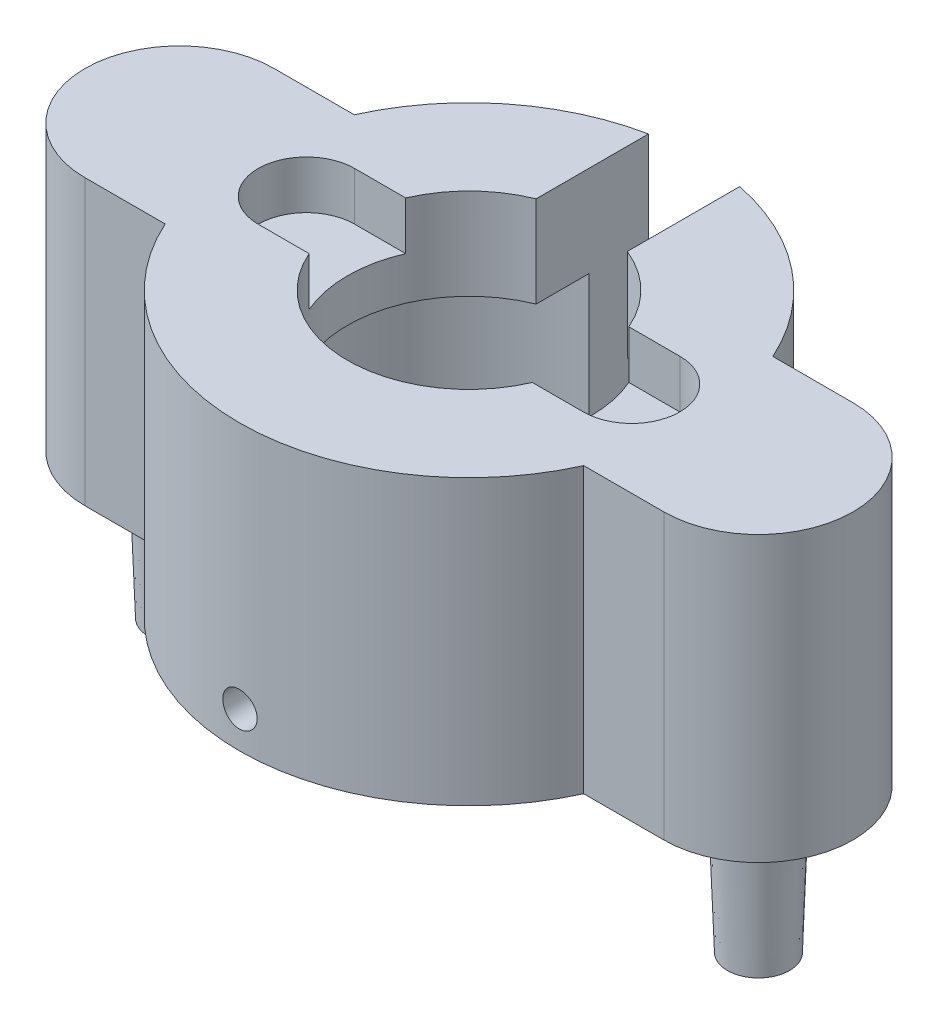
ISO-10303-21;
HEADER;
FILE_DESCRIPTION(('STEP AP214'),'2;1');
FILE_NAME('part.step','',(''),(''),'','','');
FILE_SCHEMA(('AUTOMOTIVE_DESIGN { 1 0 10303 214 1 1 1 1 }'));
ENDSEC;
DATA;
#1=APPLICATION_CONTEXT('core data for automotive mechanical design processes');
#2=APPLICATION_PROTOCOL_DEFINITION('international standard','automotive_design',2000,#1);
#3=PRODUCT_CONTEXT('',#1,'mechanical');
#4=PRODUCT('Part','Part','',(#3));
#5=PRODUCT_RELATED_PRODUCT_CATEGORY('part','',(#4));
#6=PRODUCT_DEFINITION_FORMATION('','',#4);
#7=PRODUCT_DEFINITION_CONTEXT('part definition',#1,'design');
#8=PRODUCT_DEFINITION('design','',#6,#7);
#9=PRODUCT_DEFINITION_SHAPE('','',#8);
#10=(LENGTH_UNIT() NAMED_UNIT(*) SI_UNIT(.MILLI.,.METRE.));
#11=(NAMED_UNIT(*) PLANE_ANGLE_UNIT() SI_UNIT($,.RADIAN.));
#12=(NAMED_UNIT(*) SI_UNIT($,.STERADIAN.) SOLID_ANGLE_UNIT());
#13=UNCERTAINTY_MEASURE_WITH_UNIT(LENGTH_MEASURE(1.E-05),#10,'distance_accuracy_value','');
#14=(GEOMETRIC_REPRESENTATION_CONTEXT(3) GLOBAL_UNCERTAINTY_ASSIGNED_CONTEXT((#13)) GLOBAL_UNIT_ASSIGNED_CONTEXT((#10,
#11,#12)) REPRESENTATION_CONTEXT('',''));
#15=CARTESIAN_POINT('',(0.,0.,0.));
#16=DIRECTION('',(0.,0.,1.));
#17=DIRECTION('',(1.,0.,0.));
#18=AXIS2_PLACEMENT_3D('',#15,#16,#17);
#19=CARTESIAN_POINT('',(0.,12.7,0.));
#20=DIRECTION('',(0.,-1.,0.));
#21=DIRECTION('',(0.,0.,-1.));
#22=AXIS2_PLACEMENT_3D('',#19,#20,#21);
#23=CYLINDRICAL_SURFACE('',#22,15.113);
#24=CARTESIAN_POINT('',(0.,0.,0.));
#25=DIRECTION('',(0.,1.,0.));
#26=DIRECTION('',(0.,0.,-1.));
#27=AXIS2_PLACEMENT_3D('',#24,#25,#26);
#28=CIRCLE('',#27,15.113);
#29=CARTESIAN_POINT('',(13.7723287791136,0.,-6.223));
#30=VERTEX_POINT('',#29);
#31=CARTESIAN_POINT('',(3.,0.,-14.8122506392513));
#32=VERTEX_POINT('',#31);
#33=EDGE_CURVE('E424',#30,#32,#28,.T.);
#34=ORIENTED_EDGE('',*,*,#33,.T.);
#35=DIRECTION('',(0.,-1.,0.));
#36=VECTOR('',#35,1.);
#37=CARTESIAN_POINT('',(3.,12.7,-14.8122506392513));
#38=LINE('',#37,#36);
#39=CARTESIAN_POINT('',(3.,18.7,-14.8122506392513));
#40=VERTEX_POINT('',#39);
#41=EDGE_CURVE('E256',#32,#40,#38,.F.);
#42=ORIENTED_EDGE('',*,*,#41,.T.);
#43=CARTESIAN_POINT('',(0.,18.7,0.));
#44=DIRECTION('',(0.,1.,0.));
#45=DIRECTION('',(0.,0.,1.));
#46=AXIS2_PLACEMENT_3D('',#43,#44,#45);
#47=CIRCLE('',#46,15.113);
#48=CARTESIAN_POINT('',(13.7723287791136,18.7,-6.223));
#49=VERTEX_POINT('',#48);
#50=EDGE_CURVE('E264',#49,#40,#47,.T.);
#51=ORIENTED_EDGE('',*,*,#50,.F.);
#52=DIRECTION('',(0.,-1.,0.));
#53=VECTOR('',#52,1.);
#54=CARTESIAN_POINT('',(13.7723287791136,12.7,-6.223));
#55=LINE('',#54,#53);
#56=EDGE_CURVE('E399',#49,#30,#55,.T.);
#57=ORIENTED_EDGE('',*,*,#56,.T.);
#58=EDGE_LOOP('',(#34,#42,#51,#57));
#59=FACE_BOUND('',#58,.T.);
#60=ADVANCED_FACE('F35',(#59),#23,.T.);
#61=CARTESIAN_POINT('',(-19.05,0.,0.));
#62=DIRECTION('',(0.,1.,0.));
#63=DIRECTION('',(0.,0.,1.));
#64=AXIS2_PLACEMENT_3D('',#61,#62,#63);
#65=PLANE('',#64);
#66=CARTESIAN_POINT('',(-19.05,0.,0.));
#67=DIRECTION('',(0.,1.,0.));
#68=DIRECTION('',(0.,0.,1.));
#69=AXIS2_PLACEMENT_3D('',#66,#67,#68);
#70=CIRCLE('',#69,2.38125);
#71=CARTESIAN_POINT('',(-19.05,0.,2.38125));
#72=VERTEX_POINT('',#71);
#73=EDGE_CURVE('E327',#72,#72,#70,.F.);
#74=ORIENTED_EDGE('',*,*,#73,.F.);
#75=EDGE_LOOP('',(#74));
#76=FACE_BOUND('',#75,.T.);
#77=CARTESIAN_POINT('',(0.,0.,0.));
#78=DIRECTION('',(0.,1.,0.));
#79=DIRECTION('',(0.,0.,1.));
#80=AXIS2_PLACEMENT_3D('',#77,#78,#79);
#81=CIRCLE('',#80,11.303);
#82=CARTESIAN_POINT('',(-3.,0.,-10.8976056544546));
#83=VERTEX_POINT('',#82);
#84=CARTESIAN_POINT('',(3.,0.,-10.8976056544546));
#85=VERTEX_POINT('',#84);
#86=EDGE_CURVE('E306',#83,#85,#81,.T.);
#87=ORIENTED_EDGE('',*,*,#86,.T.);
#88=DIRECTION('',(0.,0.,-1.));
#89=VECTOR('',#88,1.);
#90=CARTESIAN_POINT('',(3.,0.,0.));
#91=LINE('',#90,#89);
#92=EDGE_CURVE('E253',#85,#32,#91,.T.);
#93=ORIENTED_EDGE('',*,*,#92,.T.);
#94=ORIENTED_EDGE('',*,*,#33,.F.);
#95=DIRECTION('',(-1.,0.,0.));
#96=VECTOR('',#95,1.);
#97=CARTESIAN_POINT('',(19.05,0.,-6.223));
#98=LINE('',#97,#96);
#99=CARTESIAN_POINT('',(19.05,0.,-6.223));
#100=VERTEX_POINT('',#99);
#101=EDGE_CURVE('E421',#100,#30,#98,.T.);
#102=ORIENTED_EDGE('',*,*,#101,.F.);
#103=CARTESIAN_POINT('',(19.05,0.,0.));
#104=DIRECTION('',(0.,1.,0.));
#105=DIRECTION('',(0.,0.,-1.));
#106=AXIS2_PLACEMENT_3D('',#103,#104,#105);
#107=CIRCLE('',#106,6.223);
#108=CARTESIAN_POINT('',(19.05,0.,6.223));
#109=VERTEX_POINT('',#108);
#110=EDGE_CURVE('E419',#109,#100,#107,.T.);
#111=ORIENTED_EDGE('',*,*,#110,.F.);
#112=DIRECTION('',(1.,0.,0.));
#113=VECTOR('',#112,1.);
#114=CARTESIAN_POINT('',(19.05,0.,6.223));
#115=LINE('',#114,#113);
#116=CARTESIAN_POINT('',(13.7723287791136,0.,6.223));
#117=VERTEX_POINT('',#116);
#118=EDGE_CURVE('E391',#117,#109,#115,.T.);
#119=ORIENTED_EDGE('',*,*,#118,.F.);
#120=CARTESIAN_POINT('',(0.,0.,0.));
#121=DIRECTION('',(0.,1.,0.));
#122=DIRECTION('',(0.,0.,1.));
#123=AXIS2_PLACEMENT_3D('',#120,#121,#122);
#124=CIRCLE('',#123,15.113);
#125=CARTESIAN_POINT('',(-13.7723287791136,0.,6.223));
#126=VERTEX_POINT('',#125);
#127=EDGE_CURVE('E413',#126,#117,#124,.T.);
#128=ORIENTED_EDGE('',*,*,#127,.F.);
#129=DIRECTION('',(1.,0.,0.));
#130=VECTOR('',#129,1.);
#131=CARTESIAN_POINT('',(-19.05,0.,6.223));
#132=LINE('',#131,#130);
#133=CARTESIAN_POINT('',(-19.05,0.,6.223));
#134=VERTEX_POINT('',#133);
#135=EDGE_CURVE('E405',#134,#126,#132,.T.);
#136=ORIENTED_EDGE('',*,*,#135,.F.);
#137=CARTESIAN_POINT('',(-19.05,0.,0.));
#138=DIRECTION('',(0.,1.,0.));
#139=DIRECTION('',(0.,0.,1.));
#140=AXIS2_PLACEMENT_3D('',#137,#138,#139);
#141=CIRCLE('',#140,6.223);
#142=CARTESIAN_POINT('',(-19.05,0.,-6.223));
#143=VERTEX_POINT('',#142);
#144=EDGE_CURVE('E409',#143,#134,#141,.T.);
#145=ORIENTED_EDGE('',*,*,#144,.F.);
#146=DIRECTION('',(-1.,0.,0.));
#147=VECTOR('',#146,1.);
#148=CARTESIAN_POINT('',(-19.05,0.,-6.223));
#149=LINE('',#148,#147);
#150=CARTESIAN_POINT('',(-13.7723287791136,0.,-6.223));
#151=VERTEX_POINT('',#150);
#152=EDGE_CURVE('E426',#151,#143,#149,.T.);
#153=ORIENTED_EDGE('',*,*,#152,.F.);
#154=CARTESIAN_POINT('',(-3.,0.,-14.8122506392513));
#155=VERTEX_POINT('',#154);
#156=EDGE_CURVE('E423',#155,#151,#28,.T.);
#157=ORIENTED_EDGE('',*,*,#156,.F.);
#158=DIRECTION('',(0.,0.,1.));
#159=VECTOR('',#158,1.);
#160=CARTESIAN_POINT('',(-3.,0.,0.));
#161=LINE('',#160,#159);
#162=EDGE_CURVE('E242',#155,#83,#161,.T.);
#163=ORIENTED_EDGE('',*,*,#162,.T.);
#164=EDGE_LOOP('',(#87,#93,#94,#102,#111,#119,#128,#136,#145,#153,#157,#163));
#165=FACE_BOUND('',#164,.T.);
#166=CARTESIAN_POINT('',(19.05,0.,0.));
#167=DIRECTION('',(0.,1.,0.));
#168=DIRECTION('',(0.,0.,1.));
#169=AXIS2_PLACEMENT_3D('',#166,#167,#168);
#170=CIRCLE('',#169,2.38125);
#171=CARTESIAN_POINT('',(19.05,0.,2.38125));
#172=VERTEX_POINT('',#171);
#173=EDGE_CURVE('E455',#172,#172,#170,.F.);
#174=ORIENTED_EDGE('',*,*,#173,.F.);
#175=EDGE_LOOP('',(#174));
#176=FACE_BOUND('',#175,.T.);
#177=ADVANCED_FACE('F344',(#76,#165,#176),#65,.F.);
#178=CARTESIAN_POINT('',(-19.05,12.7,0.));
#179=DIRECTION('',(0.,-1.,0.));
#180=DIRECTION('',(0.,0.,-1.));
#181=AXIS2_PLACEMENT_3D('',#178,#179,#180);
#182=CYLINDRICAL_SURFACE('',#181,6.223);
#183=ORIENTED_EDGE('',*,*,#144,.T.);
#184=DIRECTION('',(0.,-1.,0.));
#185=VECTOR('',#184,1.);
#186=CARTESIAN_POINT('',(-19.05,12.7,6.223));
#187=LINE('',#186,#185);
#188=CARTESIAN_POINT('',(-19.05,18.7,6.223));
#189=VERTEX_POINT('',#188);
#190=EDGE_CURVE('E328',#189,#134,#187,.T.);
#191=ORIENTED_EDGE('',*,*,#190,.F.);
#192=CARTESIAN_POINT('',(-19.05,18.7,0.));
#193=DIRECTION('',(0.,1.,0.));
#194=DIRECTION('',(0.,0.,1.));
#195=AXIS2_PLACEMENT_3D('',#192,#193,#194);
#196=CIRCLE('',#195,6.223);
#197=CARTESIAN_POINT('',(-19.05,18.7,-6.223));
#198=VERTEX_POINT('',#197);
#199=EDGE_CURVE('E271',#198,#189,#196,.T.);
#200=ORIENTED_EDGE('',*,*,#199,.F.);
#201=DIRECTION('',(0.,-1.,0.));
#202=VECTOR('',#201,1.);
#203=CARTESIAN_POINT('',(-19.05,12.7,-6.223));
#204=LINE('',#203,#202);
#205=EDGE_CURVE('E410',#198,#143,#204,.T.);
#206=ORIENTED_EDGE('',*,*,#205,.T.);
#207=EDGE_LOOP('',(#183,#191,#200,#206));
#208=FACE_BOUND('',#207,.T.);
#209=ADVANCED_FACE('F37',(#208),#182,.T.);
#210=CARTESIAN_POINT('',(-19.05,12.7,6.223));
#211=DIRECTION('',(0.,0.,-1.));
#212=DIRECTION('',(-1.,0.,0.));
#213=AXIS2_PLACEMENT_3D('',#210,#211,#212);
#214=PLANE('',#213);
#215=ORIENTED_EDGE('',*,*,#135,.T.);
#216=DIRECTION('',(0.,-1.,0.));
#217=VECTOR('',#216,1.);
#218=CARTESIAN_POINT('',(-13.7723287791136,12.7,6.223));
#219=LINE('',#218,#217);
#220=CARTESIAN_POINT('',(-13.7723287791136,18.7,6.223));
#221=VERTEX_POINT('',#220);
#222=EDGE_CURVE('E396',#221,#126,#219,.T.);
#223=ORIENTED_EDGE('',*,*,#222,.F.);
#224=DIRECTION('',(1.,0.,0.));
#225=VECTOR('',#224,1.);
#226=CARTESIAN_POINT('',(-45.8751236259975,18.7,6.223));
#227=LINE('',#226,#225);
#228=EDGE_CURVE('E274',#189,#221,#227,.T.);
#229=ORIENTED_EDGE('',*,*,#228,.F.);
#230=ORIENTED_EDGE('',*,*,#190,.T.);
#231=EDGE_LOOP('',(#215,#223,#229,#230));
#232=FACE_BOUND('',#231,.T.);
#233=ADVANCED_FACE('F336',(#232),#214,.F.);
#234=CARTESIAN_POINT('',(0.,12.7,0.));
#235=DIRECTION('',(0.,-1.,0.));
#236=DIRECTION('',(0.,0.,-1.));
#237=AXIS2_PLACEMENT_3D('',#234,#235,#236);
#238=CYLINDRICAL_SURFACE('',#237,15.113);
#239=CARTESIAN_POINT('',(1.13029999999999,2.38125,15.0706732069274));
#240=CARTESIAN_POINT('',(1.13029722137086,2.31785588375853,15.0706737701951));
#241=CARTESIAN_POINT('',(1.12494877355354,2.25441806209103,15.0710775078644));
#242=CARTESIAN_POINT('',(1.10369064185523,2.12929607343654,15.0726489104937));
#243=CARTESIAN_POINT('',(1.08776884622117,2.06761400226035,15.0738174515126));
#244=CARTESIAN_POINT('',(1.04582566562337,1.94783390980964,15.0767853693559));
#245=CARTESIAN_POINT('',(1.01980983088675,1.8897339392208,15.0785843994522));
#246=CARTESIAN_POINT('',(0.958426554842375,1.77873993584158,15.0826101525663));
#247=CARTESIAN_POINT('',(0.923061175856048,1.72584475850494,15.0848367812348));
#248=CARTESIAN_POINT('',(0.843902303255772,1.62663664714096,15.0894720932301));
#249=CARTESIAN_POINT('',(0.800093309835559,1.58033609485125,15.0918811063414));
#250=CARTESIAN_POINT('',(0.705323313552731,1.4957377579247,15.096606712582));
#251=CARTESIAN_POINT('',(0.654362004734719,1.45744031581232,15.0989233017522));
#252=CARTESIAN_POINT('',(0.546661565412864,1.38989526589844,15.1032060665152));
#253=CARTESIAN_POINT('',(0.489915805615125,1.36065820032381,15.105171832788));
#254=CARTESIAN_POINT('',(0.37230361510214,1.31213128610217,15.108527935222));
#255=CARTESIAN_POINT('',(0.31143724405126,1.2928412934614,15.1099182797129));
#256=CARTESIAN_POINT('',(0.187433440347154,1.26479126955089,15.1119645878653));
#257=CARTESIAN_POINT('',(0.124300510823074,1.25601143314772,15.1126219326166));
#258=CARTESIAN_POINT('',(-0.00254614164941989,1.2491697516225,15.1131328449506));
#259=CARTESIAN_POINT('',(-0.0662598556714341,1.25110774204858,15.112986424866));
#260=CARTESIAN_POINT('',(-0.192325253881592,1.26563044582372,15.1119074500799));
#261=CARTESIAN_POINT('',(-0.254679407106953,1.27819385958775,15.1109764681143));
#262=CARTESIAN_POINT('',(-0.376391395122113,1.31357769065734,15.1084349365291));
#263=CARTESIAN_POINT('',(-0.435749206144248,1.33639818931021,15.1068243815201));
#264=CARTESIAN_POINT('',(-0.54985160757578,1.39167230832391,15.1031022494202));
#265=CARTESIAN_POINT('',(-0.604591535637597,1.42413551825633,15.1009901739941));
#266=CARTESIAN_POINT('',(-0.707853408069916,1.49776658167394,15.0965025078786));
#267=CARTESIAN_POINT('',(-0.756375251235387,1.53893457680859,15.0941269129012));
#268=CARTESIAN_POINT('',(-0.845948035843131,1.62892675961339,15.0893724885778));
#269=CARTESIAN_POINT('',(-0.886980394595585,1.67776944597702,15.0869936655537));
#270=CARTESIAN_POINT('',(-0.9602660169808,1.7816599285701,15.0825067727831));
#271=CARTESIAN_POINT('',(-0.992519275251074,1.83670772858975,15.080398703202));
#272=CARTESIAN_POINT('',(-1.04733016458773,1.95145833337561,15.0766915122598));
#273=CARTESIAN_POINT('',(-1.06988691211389,2.01116156175635,15.0750924372814));
#274=CARTESIAN_POINT('',(-1.10465113288388,2.133522405057,15.0725850901333));
#275=CARTESIAN_POINT('',(-1.11685878093142,2.19617997005717,15.0716768062957));
#276=CARTESIAN_POINT('',(-1.13055491418153,2.32250849103495,15.0706556794053));
#277=CARTESIAN_POINT('',(-1.13206927635497,2.38617662665941,15.0705409161047));
#278=CARTESIAN_POINT('',(-1.12440355785767,2.51286167734717,15.0711147510172));
#279=CARTESIAN_POINT('',(-1.11522355727848,2.57587859728395,15.0718033432138));
#280=CARTESIAN_POINT('',(-1.08645123816977,2.69939860596434,15.0739045453173));
#281=CARTESIAN_POINT('',(-1.06687092534534,2.75990450667822,15.0753163203441));
#282=CARTESIAN_POINT('',(-1.01786597920955,2.87677190503185,15.0787041088435));
#283=CARTESIAN_POINT('',(-0.988441218289862,2.93313334893766,15.0806801296301));
#284=CARTESIAN_POINT('',(-0.920516868978237,3.04023055580595,15.0849784079934));
#285=CARTESIAN_POINT('',(-0.881999994365935,3.09095532857911,15.0873013219653));
#286=CARTESIAN_POINT('',(-0.797009821139765,3.18522838985031,15.0920293870209));
#287=CARTESIAN_POINT('',(-0.750536411944533,3.22877657859038,15.0944345392472));
#288=CARTESIAN_POINT('',(-0.650840755245077,3.30754821853012,15.0990617476379));
#289=CARTESIAN_POINT('',(-0.597605227489528,3.34275488689266,15.1012834289155));
#290=CARTESIAN_POINT('',(-0.485962931853675,3.40372908583975,15.1052879760866));
#291=CARTESIAN_POINT('',(-0.427556206944926,3.42949669485175,15.1070708456262));
#292=CARTESIAN_POINT('',(-0.307290299786674,3.47083233852555,15.1099951373838));
#293=CARTESIAN_POINT('',(-0.245434738310566,3.48641085930316,15.1111372188971));
#294=CARTESIAN_POINT('',(-0.119977052308515,3.50696040172483,15.112653910336));
#295=CARTESIAN_POINT('',(-0.0563749537901997,3.51193158123582,15.1130285316836));
#296=CARTESIAN_POINT('',(0.0706046572992152,3.51112363798842,15.1129681191839));
#297=CARTESIAN_POINT('',(0.133982339186342,3.50537071790012,15.1125350587801));
#298=CARTESIAN_POINT('',(0.258868918153199,3.48333238370737,15.1109118639284));
#299=CARTESIAN_POINT('',(0.320377812322328,3.4670469531996,15.1097217283014));
#300=CARTESIAN_POINT('',(0.439783432952838,3.42441223879512,15.1067180169926));
#301=CARTESIAN_POINT('',(0.497680275323642,3.39806327802686,15.1049044613282));
#302=CARTESIAN_POINT('',(0.608232458754938,3.33605265429936,15.1008571252706));
#303=CARTESIAN_POINT('',(0.66088790613235,3.30039118028916,15.0986233534037));
#304=CARTESIAN_POINT('',(0.75959637417285,3.220669819992,15.0939800527908));
#305=CARTESIAN_POINT('',(0.805633822059471,3.17659067532353,15.0915701289946));
#306=CARTESIAN_POINT('',(0.889673663282464,3.08131725901647,15.0868494540956));
#307=CARTESIAN_POINT('',(0.92767409917902,3.03012125906525,15.0845387272615));
#308=CARTESIAN_POINT('',(0.99460214164187,2.92198641971965,15.0802740530084));
#309=CARTESIAN_POINT('',(1.02351524119432,2.8650385876547,15.0783206781222));
#310=CARTESIAN_POINT('',(1.07133301958831,2.74712201508741,15.0749989863012));
#311=CARTESIAN_POINT('',(1.09024930104004,2.68615802873123,15.0736299914737));
#312=CARTESIAN_POINT('',(1.11267466998762,2.58423194357493,15.0719871333867));
#313=CARTESIAN_POINT('',(1.11927548970071,2.54392692221476,15.0714966477224));
#314=CARTESIAN_POINT('',(1.12808904434025,2.46283730180263,15.0708395035611));
#315=CARTESIAN_POINT('',(1.13030178842434,2.4220527037517,15.0706728443883));
#316=CARTESIAN_POINT('',(1.13029999999999,2.38125,15.0706732069274));
#317=B_SPLINE_CURVE_WITH_KNOTS('',3,(#239,#240,#241,#242,#243,#244,#245,#246,#247,#248,#249,
#250,#251,#252,#253,#254,#255,#256,#257,#258,#259,#260,#261,#262,#263,#264,#265,#266,#267,#268,
#269,#270,#271,#272,#273,#274,#275,#276,#277,#278,#279,#280,#281,#282,#283,#284,#285,#286,#287,
#288,#289,#290,#291,#292,#293,#294,#295,#296,#297,#298,#299,#300,#301,#302,#303,#304,#305,#306,
#307,#308,#309,#310,#311,#312,#313,#314,#315,#316),.UNSPECIFIED.,.T.,.F.,(4,2,2,2,2,2,2,2,2,2,2,
2,2,2,2,2,2,2,2,2,2,2,2,2,2,2,2,2,2,2,2,2,2,2,2,2,2,2,4),(0.,0.19003338088971,0.380284821072064,
0.570431799039866,0.760536869353118,0.950994294653581,1.14145986965725,1.3321462364606,
1.52282984281218,1.71315356020709,1.90347435732689,2.09341454166152,2.28335623240811,
2.47348745416443,2.66362177008772,2.85422161239851,3.04482157113205,3.23543889353964,
3.42605299621999,3.61620566811966,3.80635691594902,3.99628913629515,4.18622381872648,
4.37652256162524,4.56682394954528,4.75750502596958,4.94818451802313,5.13866746190537,
5.32914757084863,5.51916288117373,5.70917848742889,5.89918799301297,6.0891936436417,
6.27963932293356,6.47013133259786,6.66092591678838,6.85149856995416,6.97381105548076,
7.09612328574898),.UNSPECIFIED.);
#318=CARTESIAN_POINT('',(1.13029999999999,2.38125,15.0706732069274));
#319=VERTEX_POINT('',#318);
#320=EDGE_CURVE('E320',#319,#319,#317,.T.);
#321=ORIENTED_EDGE('',*,*,#320,.T.);
#322=EDGE_LOOP('',(#321));
#323=FACE_BOUND('',#322,.T.);
#324=ORIENTED_EDGE('',*,*,#127,.T.);
#325=DIRECTION('',(0.,-1.,0.));
#326=VECTOR('',#325,1.);
#327=CARTESIAN_POINT('',(13.7723287791136,12.7,6.223));
#328=LINE('',#327,#326);
#329=CARTESIAN_POINT('',(13.7723287791136,18.7,6.223));
#330=VERTEX_POINT('',#329);
#331=EDGE_CURVE('E387',#330,#117,#328,.T.);
#332=ORIENTED_EDGE('',*,*,#331,.F.);
#333=EDGE_CURVE('E268',#221,#330,#47,.T.);
#334=ORIENTED_EDGE('',*,*,#333,.F.);
#335=ORIENTED_EDGE('',*,*,#222,.T.);
#336=EDGE_LOOP('',(#324,#332,#334,#335));
#337=FACE_BOUND('',#336,.T.);
#338=ADVANCED_FACE('F331',(#323,#337),#238,.T.);
#339=CARTESIAN_POINT('',(19.05,12.7,6.223));
#340=DIRECTION('',(0.,0.,-1.));
#341=DIRECTION('',(-1.,0.,0.));
#342=AXIS2_PLACEMENT_3D('',#339,#340,#341);
#343=PLANE('',#342);
#344=ORIENTED_EDGE('',*,*,#118,.T.);
#345=DIRECTION('',(0.,-1.,0.));
#346=VECTOR('',#345,1.);
#347=CARTESIAN_POINT('',(19.05,12.7,6.223));
#348=LINE('',#347,#346);
#349=CARTESIAN_POINT('',(19.05,18.7,6.223));
#350=VERTEX_POINT('',#349);
#351=EDGE_CURVE('E390',#350,#109,#348,.T.);
#352=ORIENTED_EDGE('',*,*,#351,.F.);
#353=DIRECTION('',(1.,0.,0.));
#354=VECTOR('',#353,1.);
#355=CARTESIAN_POINT('',(-45.8751236259975,18.7,6.223));
#356=LINE('',#355,#354);
#357=EDGE_CURVE('E277',#330,#350,#356,.T.);
#358=ORIENTED_EDGE('',*,*,#357,.F.);
#359=ORIENTED_EDGE('',*,*,#331,.T.);
#360=EDGE_LOOP('',(#344,#352,#358,#359));
#361=FACE_BOUND('',#360,.T.);
#362=ADVANCED_FACE('F335',(#361),#343,.F.);
#363=CARTESIAN_POINT('',(19.05,12.7,0.));
#364=DIRECTION('',(0.,-1.,0.));
#365=DIRECTION('',(0.,0.,-1.));
#366=AXIS2_PLACEMENT_3D('',#363,#364,#365);
#367=CYLINDRICAL_SURFACE('',#366,6.223);
#368=ORIENTED_EDGE('',*,*,#110,.T.);
#369=DIRECTION('',(0.,-1.,0.));
#370=VECTOR('',#369,1.);
#371=CARTESIAN_POINT('',(19.05,12.7,-6.223));
#372=LINE('',#371,#370);
#373=CARTESIAN_POINT('',(19.05,18.7,-6.223));
#374=VERTEX_POINT('',#373);
#375=EDGE_CURVE('E394',#374,#100,#372,.T.);
#376=ORIENTED_EDGE('',*,*,#375,.F.);
#377=CARTESIAN_POINT('',(19.05,18.7,0.));
#378=DIRECTION('',(0.,1.,0.));
#379=DIRECTION('',(0.,0.,1.));
#380=AXIS2_PLACEMENT_3D('',#377,#378,#379);
#381=CIRCLE('',#380,6.223);
#382=EDGE_CURVE('E280',#350,#374,#381,.T.);
#383=ORIENTED_EDGE('',*,*,#382,.F.);
#384=ORIENTED_EDGE('',*,*,#351,.T.);
#385=EDGE_LOOP('',(#368,#376,#383,#384));
#386=FACE_BOUND('',#385,.T.);
#387=ADVANCED_FACE('F366',(#386),#367,.T.);
#388=CARTESIAN_POINT('',(19.05,12.7,-6.223));
#389=DIRECTION('',(0.,0.,1.));
#390=DIRECTION('',(1.,0.,0.));
#391=AXIS2_PLACEMENT_3D('',#388,#389,#390);
#392=PLANE('',#391);
#393=ORIENTED_EDGE('',*,*,#101,.T.);
#394=ORIENTED_EDGE('',*,*,#56,.F.);
#395=DIRECTION('',(-1.,0.,0.));
#396=VECTOR('',#395,1.);
#397=CARTESIAN_POINT('',(-45.8751236259975,18.7,-6.223));
#398=LINE('',#397,#396);
#399=EDGE_CURVE('E260',#374,#49,#398,.T.);
#400=ORIENTED_EDGE('',*,*,#399,.F.);
#401=ORIENTED_EDGE('',*,*,#375,.T.);
#402=EDGE_LOOP('',(#393,#394,#400,#401));
#403=FACE_BOUND('',#402,.T.);
#404=ADVANCED_FACE('F359',(#403),#392,.F.);
#405=CARTESIAN_POINT('',(-3.,18.7,-14.8122506392513));
#406=VERTEX_POINT('',#405);
#407=CARTESIAN_POINT('',(-13.7723287791136,18.7,-6.223));
#408=VERTEX_POINT('',#407);
#409=EDGE_CURVE('E263',#406,#408,#47,.T.);
#410=ORIENTED_EDGE('',*,*,#409,.F.);
#411=DIRECTION('',(0.,-1.,0.));
#412=VECTOR('',#411,1.);
#413=CARTESIAN_POINT('',(-3.,12.7,-14.8122506392513));
#414=LINE('',#413,#412);
#415=EDGE_CURVE('E245',#406,#155,#414,.T.);
#416=ORIENTED_EDGE('',*,*,#415,.T.);
#417=ORIENTED_EDGE('',*,*,#156,.T.);
#418=DIRECTION('',(0.,-1.,0.));
#419=VECTOR('',#418,1.);
#420=CARTESIAN_POINT('',(-13.7723287791136,12.7,-6.223));
#421=LINE('',#420,#419);
#422=EDGE_CURVE('E372',#408,#151,#421,.T.);
#423=ORIENTED_EDGE('',*,*,#422,.F.);
#424=EDGE_LOOP('',(#410,#416,#417,#423));
#425=FACE_BOUND('',#424,.T.);
#426=ADVANCED_FACE('F349',(#425),#23,.T.);
#427=CARTESIAN_POINT('',(-19.05,12.7,-6.223));
#428=DIRECTION('',(0.,0.,1.));
#429=DIRECTION('',(1.,0.,0.));
#430=AXIS2_PLACEMENT_3D('',#427,#428,#429);
#431=PLANE('',#430);
#432=ORIENTED_EDGE('',*,*,#152,.T.);
#433=ORIENTED_EDGE('',*,*,#205,.F.);
#434=DIRECTION('',(-1.,0.,0.));
#435=VECTOR('',#434,1.);
#436=CARTESIAN_POINT('',(-45.8751236259975,18.7,-6.223));
#437=LINE('',#436,#435);
#438=EDGE_CURVE('E267',#408,#198,#437,.T.);
#439=ORIENTED_EDGE('',*,*,#438,.F.);
#440=ORIENTED_EDGE('',*,*,#422,.T.);
#441=EDGE_LOOP('',(#432,#433,#439,#440));
#442=FACE_BOUND('',#441,.T.);
#443=ADVANCED_FACE('F358',(#442),#431,.F.);
#444=CARTESIAN_POINT('',(0.,12.7,0.));
#445=DIRECTION('',(0.,-1.,0.));
#446=DIRECTION('',(0.,0.,-1.));
#447=AXIS2_PLACEMENT_3D('',#444,#445,#446);
#448=CYLINDRICAL_SURFACE('',#447,11.303);
#449=DIRECTION('',(0.,-1.,0.));
#450=VECTOR('',#449,1.);
#451=CARTESIAN_POINT('',(3.,12.7,-10.8976056544546));
#452=LINE('',#451,#450);
#453=CARTESIAN_POINT('',(3.,12.7,-10.8976056544546));
#454=VERTEX_POINT('',#453);
#455=EDGE_CURVE('E251',#85,#454,#452,.F.);
#456=ORIENTED_EDGE('',*,*,#455,.F.);
#457=ORIENTED_EDGE('',*,*,#86,.F.);
#458=DIRECTION('',(0.,-1.,0.));
#459=VECTOR('',#458,1.);
#460=CARTESIAN_POINT('',(-3.,12.7,-10.8976056544546));
#461=LINE('',#460,#459);
#462=CARTESIAN_POINT('',(-3.,12.7,-10.8976056544546));
#463=VERTEX_POINT('',#462);
#464=EDGE_CURVE('E240',#463,#83,#461,.T.);
#465=ORIENTED_EDGE('',*,*,#464,.F.);
#466=CARTESIAN_POINT('',(0.,12.7,0.));
#467=DIRECTION('',(0.,1.,0.));
#468=DIRECTION('',(0.,0.,1.));
#469=AXIS2_PLACEMENT_3D('',#466,#467,#468);
#470=CIRCLE('',#469,11.303);
#471=EDGE_CURVE('E287',#463,#454,#470,.T.);
#472=ORIENTED_EDGE('',*,*,#471,.T.);
#473=EDGE_LOOP('',(#456,#457,#465,#472));
#474=FACE_BOUND('',#473,.T.);
#475=CARTESIAN_POINT('',(1.13029999999999,2.38125,11.2463430016161));
#476=CARTESIAN_POINT('',(1.13029725720668,2.31793108661458,11.2463437441134));
#477=CARTESIAN_POINT('',(1.12496143370788,2.2545703068441,11.2468835098056));
#478=CARTESIAN_POINT('',(1.10375639057724,2.12960544893242,11.2489839526694));
#479=CARTESIAN_POINT('',(1.08787556268613,2.06800338487223,11.2505457549022));
#480=CARTESIAN_POINT('',(1.0460475691927,1.94838373453801,11.2545116338346));
#481=CARTESIAN_POINT('',(1.02010650626699,1.89036399986086,11.2569151998234));
#482=CARTESIAN_POINT('',(0.958906131432154,1.77951468437264,11.2622931562033));
#483=CARTESIAN_POINT('',(0.923648670233976,1.72668407559306,11.2652674331901));
#484=CARTESIAN_POINT('',(0.844678572487128,1.62750801668794,11.271463801602));
#485=CARTESIAN_POINT('',(0.800938964687759,1.58118408875788,11.2746866632395));
#486=CARTESIAN_POINT('',(0.706303802825697,1.49652168054327,11.2810100726793));
#487=CARTESIAN_POINT('',(0.655407921524489,1.45818356562905,11.2841106148799));
#488=CARTESIAN_POINT('',(0.547773176574106,1.39050672020482,11.2898476388078));
#489=CARTESIAN_POINT('',(0.491022283957168,1.36118703006353,11.2924831337622));
#490=CARTESIAN_POINT('',(0.37337198124017,1.31250112721205,11.2969847341468));
#491=CARTESIAN_POINT('',(0.312472672303485,1.2931346718804,11.2988508583312));
#492=CARTESIAN_POINT('',(0.188471627934354,1.26496808305803,11.3015980501523));
#493=CARTESIAN_POINT('',(0.125377992903795,1.25613261454275,11.3024824112474));
#494=CARTESIAN_POINT('',(-0.00140240920071243,1.24916947329817,11.303177633412));
#495=CARTESIAN_POINT('',(-0.0650891608532571,1.2510415229384,11.3029885223152));
#496=CARTESIAN_POINT('',(-0.191008090446171,1.26541159243648,11.3015608038303));
#497=CARTESIAN_POINT('',(-0.253244653075505,1.27787161602187,11.3003259492778));
#498=CARTESIAN_POINT('',(-0.374738734593971,1.31300474604837,11.2969498348815));
#499=CARTESIAN_POINT('',(-0.433996214774917,1.335677985155,11.2948085632638));
#500=CARTESIAN_POINT('',(-0.547969795682332,1.3906355973065,11.2898539043807));
#501=CARTESIAN_POINT('',(-0.602677735680554,1.42293678429835,11.2870393430152));
#502=CARTESIAN_POINT('',(-0.705910229940786,1.49622117032711,11.2810539202229));
#503=CARTESIAN_POINT('',(-0.754434602785297,1.53720462399611,11.2778830483476));
#504=CARTESIAN_POINT('',(-0.844145081991179,1.62690386361928,11.2715244620671));
#505=CARTESIAN_POINT('',(-0.885298145718939,1.67565270256141,11.2683367346809));
#506=CARTESIAN_POINT('',(-0.958842007215046,1.77938431274775,11.2623175634087));
#507=CARTESIAN_POINT('',(-0.991232792273231,1.83436709303446,11.2594861200395));
#508=CARTESIAN_POINT('',(-1.04633248222311,1.94903122058333,11.2544998387784));
#509=CARTESIAN_POINT('',(-1.06903934567361,2.00871355540759,11.2523451435753));
#510=CARTESIAN_POINT('',(-1.10410047749116,2.13107008139599,11.2489592478472));
#511=CARTESIAN_POINT('',(-1.11645506125774,2.19374418134948,11.2477280191875));
#512=CARTESIAN_POINT('',(-1.13041842762552,2.3200150701222,11.2463333197014));
#513=CARTESIAN_POINT('',(-1.13207343691033,2.38360669840534,11.2461652556226));
#514=CARTESIAN_POINT('',(-1.12471207583869,2.51016214575958,11.246903791463));
#515=CARTESIAN_POINT('',(-1.11569584967404,2.57312597330206,11.2478103768614));
#516=CARTESIAN_POINT('',(-1.08728663074584,2.69650376144921,11.2505918820064));
#517=CARTESIAN_POINT('',(-1.06791549586161,2.75692280500829,11.2524647617412));
#518=CARTESIAN_POINT('',(-1.01936865024971,2.87365395047076,11.2569661706115));
#519=CARTESIAN_POINT('',(-0.990192714933681,2.9299659582626,11.2595947170561));
#520=CARTESIAN_POINT('',(-0.922748664108655,3.03709524264472,11.2653224029726));
#521=CARTESIAN_POINT('',(-0.884449916209925,3.08789314900445,11.2684231149382));
#522=CARTESIAN_POINT('',(-0.799891306959855,3.18235583671567,11.2747406081625));
#523=CARTESIAN_POINT('',(-0.75363124848866,3.22602044139638,11.2779573922935));
#524=CARTESIAN_POINT('',(-0.654262630717178,3.30513646022986,11.2841584398407));
#525=CARTESIAN_POINT('',(-0.601129998922266,3.3405577182003,11.287141823809));
#526=CARTESIAN_POINT('',(-0.489643379996579,3.40197404817279,11.2925271161312));
#527=CARTESIAN_POINT('',(-0.431289464422602,3.42796924933267,11.2949290324523));
#528=CARTESIAN_POINT('',(-0.311121999707008,3.46974446158082,11.2988767833095));
#529=CARTESIAN_POINT('',(-0.249314834755747,3.48554268691368,11.3004241435696));
#530=CARTESIAN_POINT('',(-0.123908927245751,3.50653493754609,11.3024946950181));
#531=CARTESIAN_POINT('',(-0.0603102350893127,3.5117292608712,11.3030179149901));
#532=CARTESIAN_POINT('',(0.0665771838728161,3.51136206904292,11.3029812179549));
#533=CARTESIAN_POINT('',(0.129866052725883,3.50584736880352,11.3024260153115));
#534=CARTESIAN_POINT('',(0.254613512409195,3.48431683928391,11.3003041619075));
#535=CARTESIAN_POINT('',(0.316072101802772,3.46830100176112,11.298737510353));
#536=CARTESIAN_POINT('',(0.435414062880178,3.42623579536876,11.2947682942692));
#537=CARTESIAN_POINT('',(0.493297920957427,3.40018779502431,11.2923658437587));
#538=CARTESIAN_POINT('',(0.603879277554961,3.33880266917313,11.2869928317414));
#539=CARTESIAN_POINT('',(0.656576806419597,3.30346559801965,11.2840222735587));
#540=CARTESIAN_POINT('',(0.755529508419763,3.22432989761745,11.2778303063143));
#541=CARTESIAN_POINT('',(0.801756745905714,3.1804964146385,11.2746078977803));
#542=CARTESIAN_POINT('',(0.886220485442062,3.08568082014817,11.2682838614695));
#543=CARTESIAN_POINT('',(0.924455067195615,3.03469699561739,11.2651822628635));
#544=CARTESIAN_POINT('',(0.991924876671299,2.92688611432792,11.25944257169));
#545=CARTESIAN_POINT('',(1.02113696879055,2.87004452611942,11.2568056780317));
#546=CARTESIAN_POINT('',(1.06956299956403,2.75227290640438,11.2523082464001));
#547=CARTESIAN_POINT('',(1.0887882155129,2.69134757450276,11.2504468332179));
#548=CARTESIAN_POINT('',(1.11190062432338,2.58860608846173,11.2481805352037));
#549=CARTESIAN_POINT('',(1.1187909603237,2.54744676734834,11.2474947188692));
#550=CARTESIAN_POINT('',(1.12799154152135,2.464614346215,11.2465757085831));
#551=CARTESIAN_POINT('',(1.13030180594503,2.42294124835253,11.2463425127316));
#552=CARTESIAN_POINT('',(1.13029999999999,2.38125,11.2463430016161));
#553=B_SPLINE_CURVE_WITH_KNOTS('',3,(#475,#476,#477,#478,#479,#480,#481,#482,#483,#484,#485,
#486,#487,#488,#489,#490,#491,#492,#493,#494,#495,#496,#497,#498,#499,#500,#501,#502,#503,#504,
#505,#506,#507,#508,#509,#510,#511,#512,#513,#514,#515,#516,#517,#518,#519,#520,#521,#522,#523,
#524,#525,#526,#527,#528,#529,#530,#531,#532,#533,#534,#535,#536,#537,#538,#539,#540,#541,#542,
#543,#544,#545,#546,#547,#548,#549,#550,#551,#552),.UNSPECIFIED.,.T.,.F.,(4,2,2,2,2,2,2,2,2,2,2,
2,2,2,2,2,2,2,2,2,2,2,2,2,2,2,2,2,2,2,2,2,2,2,2,2,2,2,4),(0.,0.189804490911531,
0.379818271504143,0.56971696697444,0.759577967220205,0.950052884772736,1.14053651510191,
1.3314195910855,1.52229801385529,1.71253415556516,1.902765364749,2.09231677444631,
2.28187064641043,2.47175750840685,2.66164994014501,2.85237336973575,3.04309707597972,
3.23386096831998,3.42461904850763,3.61455241926664,3.8044832236385,3.99401468260524,
4.18355048326748,4.37373190444181,4.56391803513332,4.75478934445515,4.94565803831897,
5.13618484442432,5.32670629564788,5.51639674959422,5.70608735243318,5.89575208802222,
6.08541571384841,6.27587449907433,6.46637899102518,6.65736799781954,6.84814086624684,
6.97311489003108,7.09808838919476),.UNSPECIFIED.);
#554=CARTESIAN_POINT('',(1.13029999999999,2.38125,11.2463430016161));
#555=VERTEX_POINT('',#554);
#556=EDGE_CURVE('E299',#555,#555,#553,.T.);
#557=ORIENTED_EDGE('',*,*,#556,.F.);
#558=EDGE_LOOP('',(#557));
#559=FACE_BOUND('',#558,.T.);
#560=ADVANCED_FACE('F308',(#474,#559),#448,.F.);
#561=CARTESIAN_POINT('',(0.,2.38125,15.113));
#562=DIRECTION('',(0.,0.,1.));
#563=DIRECTION('',(1.,0.,0.));
#564=AXIS2_PLACEMENT_3D('',#561,#562,#563);
#565=CYLINDRICAL_SURFACE('',#564,1.13029999999999);
#566=ORIENTED_EDGE('',*,*,#556,.T.);
#567=EDGE_LOOP('',(#566));
#568=FACE_BOUND('',#567,.T.);
#569=ORIENTED_EDGE('',*,*,#320,.F.);
#570=EDGE_LOOP('',(#569));
#571=FACE_BOUND('',#570,.T.);
#572=ADVANCED_FACE('F311',(#568,#571),#565,.F.);
#573=CARTESIAN_POINT('',(-19.05,0.,0.));
#574=DIRECTION('',(0.,1.,0.));
#575=DIRECTION('',(0.,0.,-1.));
#576=AXIS2_PLACEMENT_3D('',#573,#574,#575);
#577=CONICAL_SURFACE('',#576,2.38125,0.0349065850398867);
#578=CARTESIAN_POINT('',(-19.05,-9.525,0.));
#579=DIRECTION('',(0.,-1.,0.));
#580=DIRECTION('',(0.,0.,-1.));
#581=AXIS2_PLACEMENT_3D('',#578,#579,#580);
#582=CIRCLE('',#581,2.0486296705911);
#583=CARTESIAN_POINT('',(-19.05,-9.525,-2.0486296705911));
#584=VERTEX_POINT('',#583);
#585=EDGE_CURVE('E296',#584,#584,#582,.T.);
#586=ORIENTED_EDGE('',*,*,#585,.F.);
#587=EDGE_LOOP('',(#586));
#588=FACE_BOUND('',#587,.T.);
#589=ORIENTED_EDGE('',*,*,#73,.T.);
#590=EDGE_LOOP('',(#589));
#591=FACE_BOUND('',#590,.T.);
#592=ADVANCED_FACE('F315',(#588,#591),#577,.T.);
#593=CARTESIAN_POINT('',(-19.05,-9.525,0.));
#594=DIRECTION('',(0.,-1.,0.));
#595=DIRECTION('',(0.,0.,-1.));
#596=AXIS2_PLACEMENT_3D('',#593,#594,#595);
#597=PLANE('',#596);
#598=ORIENTED_EDGE('',*,*,#585,.T.);
#599=EDGE_LOOP('',(#598));
#600=FACE_BOUND('',#599,.T.);
#601=ADVANCED_FACE('F515',(#600),#597,.T.);
#602=CARTESIAN_POINT('',(19.05,0.,0.));
#603=DIRECTION('',(0.,1.,0.));
#604=DIRECTION('',(0.,0.,-1.));
#605=AXIS2_PLACEMENT_3D('',#602,#603,#604);
#606=CONICAL_SURFACE('',#605,2.38125,0.0349065850398867);
#607=CARTESIAN_POINT('',(19.05,-9.525,0.));
#608=DIRECTION('',(0.,-1.,0.));
#609=DIRECTION('',(0.,0.,-1.));
#610=AXIS2_PLACEMENT_3D('',#607,#608,#609);
#611=CIRCLE('',#610,2.0486296705911);
#612=CARTESIAN_POINT('',(19.05,-9.525,-2.0486296705911));
#613=VERTEX_POINT('',#612);
#614=EDGE_CURVE('E293',#613,#613,#611,.T.);
#615=ORIENTED_EDGE('',*,*,#614,.F.);
#616=EDGE_LOOP('',(#615));
#617=FACE_BOUND('',#616,.T.);
#618=ORIENTED_EDGE('',*,*,#173,.T.);
#619=EDGE_LOOP('',(#618));
#620=FACE_BOUND('',#619,.T.);
#621=ADVANCED_FACE('F504',(#617,#620),#606,.T.);
#622=CARTESIAN_POINT('',(19.05,-9.525,0.));
#623=DIRECTION('',(0.,-1.,0.));
#624=DIRECTION('',(0.,0.,-1.));
#625=AXIS2_PLACEMENT_3D('',#622,#623,#624);
#626=PLANE('',#625);
#627=ORIENTED_EDGE('',*,*,#614,.T.);
#628=EDGE_LOOP('',(#627));
#629=FACE_BOUND('',#628,.T.);
#630=ADVANCED_FACE('F500',(#629),#626,.T.);
#631=CARTESIAN_POINT('',(0.,18.7,0.));
#632=DIRECTION('',(0.,-1.,0.));
#633=DIRECTION('',(0.,0.,-1.));
#634=AXIS2_PLACEMENT_3D('',#631,#632,#633);
#635=CYLINDRICAL_SURFACE('',#634,8.);
#636=DIRECTION('',(0.,-1.,0.));
#637=VECTOR('',#636,1.);
#638=CARTESIAN_POINT('',(7.34298134275173,18.7,-3.175));
#639=LINE('',#638,#637);
#640=CARTESIAN_POINT('',(7.34298134275173,18.7,-3.175));
#641=VERTEX_POINT('',#640);
#642=CARTESIAN_POINT('',(7.34298134275173,15.525,-3.175));
#643=VERTEX_POINT('',#642);
#644=EDGE_CURVE('E232',#641,#643,#639,.T.);
#645=ORIENTED_EDGE('',*,*,#644,.F.);
#646=CARTESIAN_POINT('',(0.,18.7,0.));
#647=DIRECTION('',(0.,1.,0.));
#648=DIRECTION('',(0.,0.,1.));
#649=AXIS2_PLACEMENT_3D('',#646,#647,#648);
#650=CIRCLE('',#649,8.);
#651=CARTESIAN_POINT('',(3.,18.7,-7.41619848709566));
#652=VERTEX_POINT('',#651);
#653=EDGE_CURVE('E283',#641,#652,#650,.T.);
#654=ORIENTED_EDGE('',*,*,#653,.T.);
#655=DIRECTION('',(0.,-1.,0.));
#656=VECTOR('',#655,1.);
#657=CARTESIAN_POINT('',(3.,18.7,-7.41619848709566));
#658=LINE('',#657,#656);
#659=CARTESIAN_POINT('',(3.,12.7,-7.41619848709566));
#660=VERTEX_POINT('',#659);
#661=EDGE_CURVE('E248',#660,#652,#658,.F.);
#662=ORIENTED_EDGE('',*,*,#661,.F.);
#663=CARTESIAN_POINT('',(0.,12.7,0.));
#664=DIRECTION('',(0.,1.,0.));
#665=DIRECTION('',(0.,0.,1.));
#666=AXIS2_PLACEMENT_3D('',#663,#664,#665);
#667=CIRCLE('',#666,8.);
#668=CARTESIAN_POINT('',(-3.,12.7,-7.41619848709566));
#669=VERTEX_POINT('',#668);
#670=EDGE_CURVE('E259',#669,#660,#667,.T.);
#671=ORIENTED_EDGE('',*,*,#670,.F.);
#672=DIRECTION('',(0.,-1.,0.));
#673=VECTOR('',#672,1.);
#674=CARTESIAN_POINT('',(-3.,18.7,-7.41619848709566));
#675=LINE('',#674,#673);
#676=CARTESIAN_POINT('',(-3.,18.7,-7.41619848709566));
#677=VERTEX_POINT('',#676);
#678=EDGE_CURVE('E238',#677,#669,#675,.T.);
#679=ORIENTED_EDGE('',*,*,#678,.F.);
#680=CARTESIAN_POINT('',(-7.34298134275173,18.7,-3.175));
#681=VERTEX_POINT('',#680);
#682=EDGE_CURVE('E284',#677,#681,#650,.T.);
#683=ORIENTED_EDGE('',*,*,#682,.T.);
#684=DIRECTION('',(0.,-1.,0.));
#685=VECTOR('',#684,1.);
#686=CARTESIAN_POINT('',(-7.34298134275173,18.7,-3.175));
#687=LINE('',#686,#685);
#688=CARTESIAN_POINT('',(-7.34298134275173,15.525,-3.175));
#689=VERTEX_POINT('',#688);
#690=EDGE_CURVE('E230',#689,#681,#687,.F.);
#691=ORIENTED_EDGE('',*,*,#690,.F.);
#692=CARTESIAN_POINT('',(0.,15.525,0.));
#693=DIRECTION('',(0.,1.,0.));
#694=DIRECTION('',(0.,0.,1.));
#695=AXIS2_PLACEMENT_3D('',#692,#693,#694);
#696=CIRCLE('',#695,8.);
#697=CARTESIAN_POINT('',(-7.34298134275173,15.525,3.175));
#698=VERTEX_POINT('',#697);
#699=EDGE_CURVE('E39',#689,#698,#696,.T.);
#700=ORIENTED_EDGE('',*,*,#699,.T.);
#701=DIRECTION('',(0.,-1.,0.));
#702=VECTOR('',#701,1.);
#703=CARTESIAN_POINT('',(-7.34298134275173,18.7,3.175));
#704=LINE('',#703,#702);
#705=CARTESIAN_POINT('',(-7.34298134275173,18.7,3.175));
#706=VERTEX_POINT('',#705);
#707=EDGE_CURVE('E198',#706,#698,#704,.T.);
#708=ORIENTED_EDGE('',*,*,#707,.F.);
#709=CARTESIAN_POINT('',(7.34298134275173,18.7,3.175));
#710=VERTEX_POINT('',#709);
#711=EDGE_CURVE('E288',#706,#710,#650,.T.);
#712=ORIENTED_EDGE('',*,*,#711,.T.);
#713=DIRECTION('',(0.,-1.,0.));
#714=VECTOR('',#713,1.);
#715=CARTESIAN_POINT('',(7.34298134275173,18.7,3.175));
#716=LINE('',#715,#714);
#717=CARTESIAN_POINT('',(7.34298134275173,15.525,3.175));
#718=VERTEX_POINT('',#717);
#719=EDGE_CURVE('E58',#718,#710,#716,.F.);
#720=ORIENTED_EDGE('',*,*,#719,.F.);
#721=EDGE_CURVE('E11',#718,#643,#696,.T.);
#722=ORIENTED_EDGE('',*,*,#721,.T.);
#723=EDGE_LOOP('',(#645,#654,#662,#671,#679,#683,#691,#700,#708,#712,#720,#722));
#724=FACE_BOUND('',#723,.T.);
#725=ADVANCED_FACE('F461',(#724),#635,.F.);
#726=CARTESIAN_POINT('',(-45.8751236259975,18.7,-1.69651308455943));
#727=DIRECTION('',(0.,1.,0.));
#728=DIRECTION('',(0.,0.,1.));
#729=AXIS2_PLACEMENT_3D('',#726,#727,#728);
#730=PLANE('',#729);
#731=DIRECTION('',(-1.,0.,0.));
#732=VECTOR('',#731,1.);
#733=CARTESIAN_POINT('',(-45.8751236259975,18.7,-3.175));
#734=LINE('',#733,#732);
#735=CARTESIAN_POINT('',(-10.700000063,18.7,-3.175));
#736=VERTEX_POINT('',#735);
#737=EDGE_CURVE('E453',#681,#736,#734,.T.);
#738=ORIENTED_EDGE('',*,*,#737,.F.);
#739=ORIENTED_EDGE('',*,*,#682,.F.);
#740=DIRECTION('',(0.,0.,1.));
#741=VECTOR('',#740,1.);
#742=CARTESIAN_POINT('',(-3.,18.7,-2.15494598279597));
#743=LINE('',#742,#741);
#744=EDGE_CURVE('E236',#406,#677,#743,.T.);
#745=ORIENTED_EDGE('',*,*,#744,.F.);
#746=ORIENTED_EDGE('',*,*,#409,.T.);
#747=ORIENTED_EDGE('',*,*,#438,.T.);
#748=ORIENTED_EDGE('',*,*,#199,.T.);
#749=ORIENTED_EDGE('',*,*,#228,.T.);
#750=ORIENTED_EDGE('',*,*,#333,.T.);
#751=ORIENTED_EDGE('',*,*,#357,.T.);
#752=ORIENTED_EDGE('',*,*,#382,.T.);
#753=ORIENTED_EDGE('',*,*,#399,.T.);
#754=ORIENTED_EDGE('',*,*,#50,.T.);
#755=DIRECTION('',(0.,0.,-1.));
#756=VECTOR('',#755,1.);
#757=CARTESIAN_POINT('',(3.,18.7,-2.15494598279597));
#758=LINE('',#757,#756);
#759=EDGE_CURVE('E234',#652,#40,#758,.T.);
#760=ORIENTED_EDGE('',*,*,#759,.F.);
#761=ORIENTED_EDGE('',*,*,#653,.F.);
#762=DIRECTION('',(-1.,0.,0.));
#763=VECTOR('',#762,1.);
#764=CARTESIAN_POINT('',(-10.700000063,18.7,-3.175));
#765=LINE('',#764,#763);
#766=CARTESIAN_POINT('',(10.700000063,18.7,-3.175));
#767=VERTEX_POINT('',#766);
#768=EDGE_CURVE('E208',#767,#641,#765,.T.);
#769=ORIENTED_EDGE('',*,*,#768,.F.);
#770=CARTESIAN_POINT('',(10.700000063,18.7,0.));
#771=DIRECTION('',(0.,1.,0.));
#772=DIRECTION('',(0.,0.,1.));
#773=AXIS2_PLACEMENT_3D('',#770,#771,#772);
#774=CIRCLE('',#773,3.175);
#775=CARTESIAN_POINT('',(10.700000063,18.7,3.175));
#776=VERTEX_POINT('',#775);
#777=EDGE_CURVE('E210',#776,#767,#774,.T.);
#778=ORIENTED_EDGE('',*,*,#777,.F.);
#779=DIRECTION('',(1.,0.,0.));
#780=VECTOR('',#779,1.);
#781=CARTESIAN_POINT('',(-45.8751236259975,18.7,3.175));
#782=LINE('',#781,#780);
#783=EDGE_CURVE('E451',#710,#776,#782,.T.);
#784=ORIENTED_EDGE('',*,*,#783,.F.);
#785=ORIENTED_EDGE('',*,*,#711,.F.);
#786=DIRECTION('',(1.,0.,0.));
#787=VECTOR('',#786,1.);
#788=CARTESIAN_POINT('',(-10.700000063,18.7,3.175));
#789=LINE('',#788,#787);
#790=CARTESIAN_POINT('',(-10.700000063,18.7,3.175));
#791=VERTEX_POINT('',#790);
#792=EDGE_CURVE('E218',#791,#706,#789,.T.);
#793=ORIENTED_EDGE('',*,*,#792,.F.);
#794=CARTESIAN_POINT('',(-10.700000063,18.7,0.));
#795=DIRECTION('',(0.,1.,0.));
#796=DIRECTION('',(0.,0.,1.));
#797=AXIS2_PLACEMENT_3D('',#794,#795,#796);
#798=CIRCLE('',#797,3.175);
#799=EDGE_CURVE('E50',#736,#791,#798,.T.);
#800=ORIENTED_EDGE('',*,*,#799,.F.);
#801=EDGE_LOOP('',(#738,#739,#745,#746,#747,#748,#749,#750,#751,#752,#753,#754,#760,#761,#769,
#778,#784,#785,#793,#800));
#802=FACE_BOUND('',#801,.T.);
#803=ADVANCED_FACE('F380',(#802),#730,.T.);
#804=CARTESIAN_POINT('',(-45.8751236259975,12.7,-1.69651308455943));
#805=DIRECTION('',(0.,1.,0.));
#806=DIRECTION('',(0.,0.,1.));
#807=AXIS2_PLACEMENT_3D('',#804,#805,#806);
#808=PLANE('',#807);
#809=ORIENTED_EDGE('',*,*,#670,.T.);
#810=DIRECTION('',(0.,0.,-1.));
#811=VECTOR('',#810,1.);
#812=CARTESIAN_POINT('',(3.,12.7,-1.69651308455943));
#813=LINE('',#812,#811);
#814=EDGE_CURVE('E449',#660,#454,#813,.T.);
#815=ORIENTED_EDGE('',*,*,#814,.T.);
#816=ORIENTED_EDGE('',*,*,#471,.F.);
#817=DIRECTION('',(0.,0.,1.));
#818=VECTOR('',#817,1.);
#819=CARTESIAN_POINT('',(-3.,12.7,-1.69651308455943));
#820=LINE('',#819,#818);
#821=EDGE_CURVE('E447',#463,#669,#820,.T.);
#822=ORIENTED_EDGE('',*,*,#821,.T.);
#823=EDGE_LOOP('',(#809,#815,#816,#822));
#824=FACE_BOUND('',#823,.T.);
#825=ADVANCED_FACE('F446',(#824),#808,.F.);
#826=CARTESIAN_POINT('',(-3.,-9.525,-2.15494598279597));
#827=DIRECTION('',(-1.,0.,0.));
#828=DIRECTION('',(0.,0.,1.));
#829=AXIS2_PLACEMENT_3D('',#826,#827,#828);
#830=PLANE('',#829);
#831=ORIENTED_EDGE('',*,*,#744,.T.);
#832=ORIENTED_EDGE('',*,*,#678,.T.);
#833=ORIENTED_EDGE('',*,*,#821,.F.);
#834=ORIENTED_EDGE('',*,*,#464,.T.);
#835=ORIENTED_EDGE('',*,*,#162,.F.);
#836=ORIENTED_EDGE('',*,*,#415,.F.);
#837=EDGE_LOOP('',(#831,#832,#833,#834,#835,#836));
#838=FACE_BOUND('',#837,.T.);
#839=ADVANCED_FACE('F619',(#838),#830,.F.);
#840=CARTESIAN_POINT('',(3.,-9.525,-2.15494598279597));
#841=DIRECTION('',(1.,0.,0.));
#842=DIRECTION('',(0.,0.,-1.));
#843=AXIS2_PLACEMENT_3D('',#840,#841,#842);
#844=PLANE('',#843);
#845=ORIENTED_EDGE('',*,*,#92,.F.);
#846=ORIENTED_EDGE('',*,*,#455,.T.);
#847=ORIENTED_EDGE('',*,*,#814,.F.);
#848=ORIENTED_EDGE('',*,*,#661,.T.);
#849=ORIENTED_EDGE('',*,*,#759,.T.);
#850=ORIENTED_EDGE('',*,*,#41,.F.);
#851=EDGE_LOOP('',(#845,#846,#847,#848,#849,#850));
#852=FACE_BOUND('',#851,.T.);
#853=ADVANCED_FACE('F438',(#852),#844,.F.);
#854=CARTESIAN_POINT('',(-10.700000063,15.525,3.175));
#855=DIRECTION('',(0.,0.,1.));
#856=DIRECTION('',(1.,0.,0.));
#857=AXIS2_PLACEMENT_3D('',#854,#855,#856);
#858=PLANE('',#857);
#859=ORIENTED_EDGE('',*,*,#719,.T.);
#860=ORIENTED_EDGE('',*,*,#783,.T.);
#861=DIRECTION('',(0.,1.,0.));
#862=VECTOR('',#861,1.);
#863=CARTESIAN_POINT('',(10.700000063,15.525,3.175));
#864=LINE('',#863,#862);
#865=CARTESIAN_POINT('',(10.700000063,15.525,3.175));
#866=VERTEX_POINT('',#865);
#867=EDGE_CURVE('E191',#866,#776,#864,.T.);
#868=ORIENTED_EDGE('',*,*,#867,.F.);
#869=DIRECTION('',(1.,0.,0.));
#870=VECTOR('',#869,1.);
#871=CARTESIAN_POINT('',(-10.700000063,15.525,3.175));
#872=LINE('',#871,#870);
#873=EDGE_CURVE('E202',#718,#866,#872,.T.);
#874=ORIENTED_EDGE('',*,*,#873,.F.);
#875=EDGE_LOOP('',(#859,#860,#868,#874));
#876=FACE_BOUND('',#875,.T.);
#877=ADVANCED_FACE('F633',(#876),#858,.F.);
#878=CARTESIAN_POINT('',(10.700000063,15.525,0.));
#879=DIRECTION('',(0.,1.,0.));
#880=DIRECTION('',(0.,0.,1.));
#881=AXIS2_PLACEMENT_3D('',#878,#879,#880);
#882=CYLINDRICAL_SURFACE('',#881,3.175);
#883=ORIENTED_EDGE('',*,*,#777,.T.);
#884=DIRECTION('',(0.,1.,0.));
#885=VECTOR('',#884,1.);
#886=CARTESIAN_POINT('',(10.700000063,15.525,-3.175));
#887=LINE('',#886,#885);
#888=CARTESIAN_POINT('',(10.700000063,15.525,-3.175));
#889=VERTEX_POINT('',#888);
#890=EDGE_CURVE('E224',#889,#767,#887,.T.);
#891=ORIENTED_EDGE('',*,*,#890,.F.);
#892=CARTESIAN_POINT('',(10.700000063,15.525,0.));
#893=DIRECTION('',(0.,1.,0.));
#894=DIRECTION('',(0.,0.,1.));
#895=AXIS2_PLACEMENT_3D('',#892,#893,#894);
#896=CIRCLE('',#895,3.175);
#897=EDGE_CURVE('E201',#866,#889,#896,.T.);
#898=ORIENTED_EDGE('',*,*,#897,.F.);
#899=ORIENTED_EDGE('',*,*,#867,.T.);
#900=EDGE_LOOP('',(#883,#891,#898,#899));
#901=FACE_BOUND('',#900,.T.);
#902=ADVANCED_FACE('F642',(#901),#882,.F.);
#903=CARTESIAN_POINT('',(-10.700000063,15.525,-3.175));
#904=DIRECTION('',(0.,0.,-1.));
#905=DIRECTION('',(-1.,0.,0.));
#906=AXIS2_PLACEMENT_3D('',#903,#904,#905);
#907=PLANE('',#906);
#908=ORIENTED_EDGE('',*,*,#644,.T.);
#909=DIRECTION('',(-1.,0.,0.));
#910=VECTOR('',#909,1.);
#911=CARTESIAN_POINT('',(-10.700000063,15.525,-3.175));
#912=LINE('',#911,#910);
#913=EDGE_CURVE('E192',#889,#643,#912,.T.);
#914=ORIENTED_EDGE('',*,*,#913,.F.);
#915=ORIENTED_EDGE('',*,*,#890,.T.);
#916=ORIENTED_EDGE('',*,*,#768,.T.);
#917=EDGE_LOOP('',(#908,#914,#915,#916));
#918=FACE_BOUND('',#917,.T.);
#919=ADVANCED_FACE('F651',(#918),#907,.F.);
#920=CARTESIAN_POINT('',(-10.700000063,15.525,0.));
#921=DIRECTION('',(0.,1.,0.));
#922=DIRECTION('',(0.,0.,1.));
#923=AXIS2_PLACEMENT_3D('',#920,#921,#922);
#924=PLANE('',#923);
#925=ORIENTED_EDGE('',*,*,#873,.T.);
#926=ORIENTED_EDGE('',*,*,#897,.T.);
#927=ORIENTED_EDGE('',*,*,#913,.T.);
#928=ORIENTED_EDGE('',*,*,#721,.F.);
#929=EDGE_LOOP('',(#925,#926,#927,#928));
#930=FACE_BOUND('',#929,.T.);
#931=ADVANCED_FACE('F660',(#930),#924,.T.);
#932=ORIENTED_EDGE('',*,*,#707,.T.);
#933=CARTESIAN_POINT('',(-10.700000063,15.525,3.175));
#934=VERTEX_POINT('',#933);
#935=EDGE_CURVE('E195',#934,#698,#872,.T.);
#936=ORIENTED_EDGE('',*,*,#935,.F.);
#937=DIRECTION('',(0.,1.,0.));
#938=VECTOR('',#937,1.);
#939=CARTESIAN_POINT('',(-10.700000063,15.525,3.175));
#940=LINE('',#939,#938);
#941=EDGE_CURVE('E184',#934,#791,#940,.T.);
#942=ORIENTED_EDGE('',*,*,#941,.T.);
#943=ORIENTED_EDGE('',*,*,#792,.T.);
#944=EDGE_LOOP('',(#932,#936,#942,#943));
#945=FACE_BOUND('',#944,.T.);
#946=ADVANCED_FACE('F196',(#945),#858,.F.);
#947=CARTESIAN_POINT('',(-10.700000063,15.525,0.));
#948=DIRECTION('',(0.,1.,0.));
#949=DIRECTION('',(0.,0.,1.));
#950=AXIS2_PLACEMENT_3D('',#947,#948,#949);
#951=CYLINDRICAL_SURFACE('',#950,3.175);
#952=ORIENTED_EDGE('',*,*,#799,.T.);
#953=ORIENTED_EDGE('',*,*,#941,.F.);
#954=CARTESIAN_POINT('',(-10.700000063,15.525,0.));
#955=DIRECTION('',(0.,1.,0.));
#956=DIRECTION('',(0.,0.,1.));
#957=AXIS2_PLACEMENT_3D('',#954,#955,#956);
#958=CIRCLE('',#957,3.175);
#959=CARTESIAN_POINT('',(-10.700000063,15.525,-3.175));
#960=VERTEX_POINT('',#959);
#961=EDGE_CURVE('E188',#960,#934,#958,.T.);
#962=ORIENTED_EDGE('',*,*,#961,.F.);
#963=DIRECTION('',(0.,1.,0.));
#964=VECTOR('',#963,1.);
#965=CARTESIAN_POINT('',(-10.700000063,15.525,-3.175));
#966=LINE('',#965,#964);
#967=EDGE_CURVE('E222',#960,#736,#966,.T.);
#968=ORIENTED_EDGE('',*,*,#967,.T.);
#969=EDGE_LOOP('',(#952,#953,#962,#968));
#970=FACE_BOUND('',#969,.T.);
#971=ADVANCED_FACE('F186',(#970),#951,.F.);
#972=ORIENTED_EDGE('',*,*,#690,.T.);
#973=ORIENTED_EDGE('',*,*,#737,.T.);
#974=ORIENTED_EDGE('',*,*,#967,.F.);
#975=EDGE_CURVE('E206',#689,#960,#912,.T.);
#976=ORIENTED_EDGE('',*,*,#975,.F.);
#977=EDGE_LOOP('',(#972,#973,#974,#976));
#978=FACE_BOUND('',#977,.T.);
#979=ADVANCED_FACE('F464',(#978),#907,.F.);
#980=ORIENTED_EDGE('',*,*,#975,.T.);
#981=ORIENTED_EDGE('',*,*,#961,.T.);
#982=ORIENTED_EDGE('',*,*,#935,.T.);
#983=ORIENTED_EDGE('',*,*,#699,.F.);
#984=EDGE_LOOP('',(#980,#981,#982,#983));
#985=FACE_BOUND('',#984,.T.);
#986=ADVANCED_FACE('F204',(#985),#924,.T.);
#987=CLOSED_SHELL('',(#60,#177,#209,#233,#338,#362,#387,#404,#426,#443,#560,#572,#592,#601,#621,
#630,#725,#803,#825,#839,#853,#877,#902,#919,#931,#946,#971,#979,#986));
#988=MANIFOLD_SOLID_BREP('B2',#987);
#989=ADVANCED_BREP_SHAPE_REPRESENTATION('',(#18,#988),#14);
#990=SHAPE_DEFINITION_REPRESENTATION(#9,#989);
ENDSEC;
END-ISO-10303-21;
